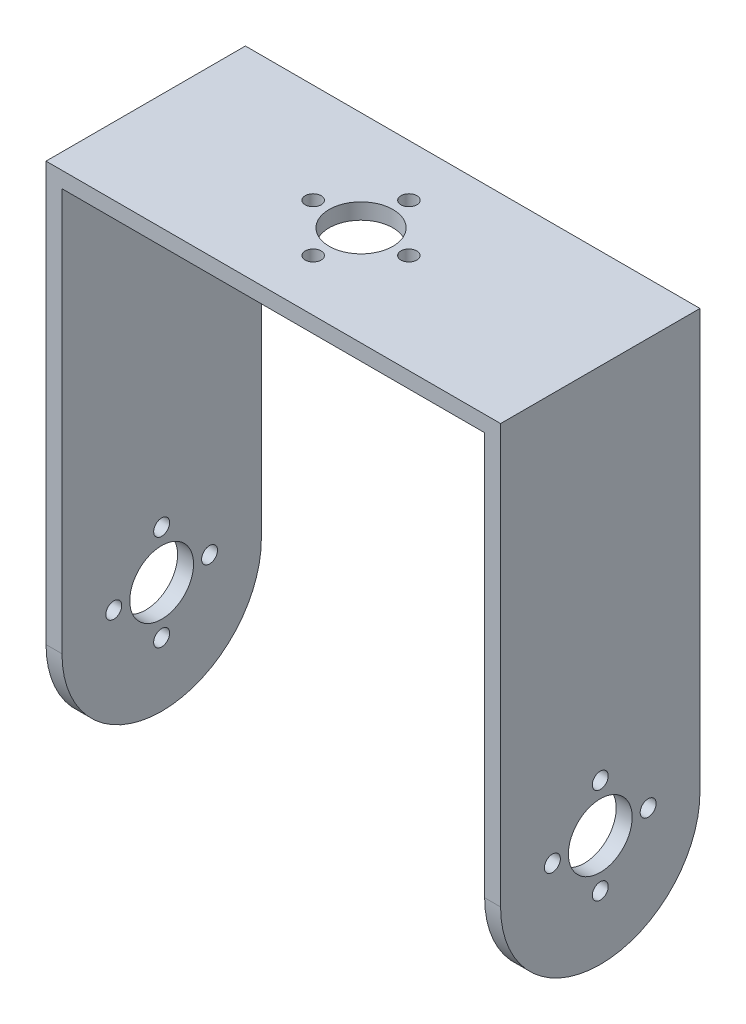
ISO-10303-21;
HEADER;
FILE_DESCRIPTION(('STEP AP214'),'2;1');
FILE_NAME('part.step','',(''),(''),'','','');
FILE_SCHEMA(('AUTOMOTIVE_DESIGN { 1 0 10303 214 1 1 1 1 }'));
ENDSEC;
DATA;
#1=APPLICATION_CONTEXT('core data for automotive mechanical design processes');
#2=APPLICATION_PROTOCOL_DEFINITION('international standard','automotive_design',2000,#1);
#3=PRODUCT_CONTEXT('',#1,'mechanical');
#4=PRODUCT('Part','Part','',(#3));
#5=PRODUCT_RELATED_PRODUCT_CATEGORY('part','',(#4));
#6=PRODUCT_DEFINITION_FORMATION('','',#4);
#7=PRODUCT_DEFINITION_CONTEXT('part definition',#1,'design');
#8=PRODUCT_DEFINITION('design','',#6,#7);
#9=PRODUCT_DEFINITION_SHAPE('','',#8);
#10=(LENGTH_UNIT() NAMED_UNIT(*) SI_UNIT(.MILLI.,.METRE.));
#11=(NAMED_UNIT(*) PLANE_ANGLE_UNIT() SI_UNIT($,.RADIAN.));
#12=(NAMED_UNIT(*) SI_UNIT($,.STERADIAN.) SOLID_ANGLE_UNIT());
#13=UNCERTAINTY_MEASURE_WITH_UNIT(LENGTH_MEASURE(1.E-05),#10,'distance_accuracy_value','');
#14=(GEOMETRIC_REPRESENTATION_CONTEXT(3) GLOBAL_UNCERTAINTY_ASSIGNED_CONTEXT((#13)) GLOBAL_UNIT_ASSIGNED_CONTEXT((#10,
#11,#12)) REPRESENTATION_CONTEXT('',''));
#15=CARTESIAN_POINT('',(0.,0.,0.));
#16=DIRECTION('',(0.,0.,1.));
#17=DIRECTION('',(1.,0.,0.));
#18=AXIS2_PLACEMENT_3D('',#15,#16,#17);
#19=CARTESIAN_POINT('',(-79.925523148209,43.3899538371544,25.));
#20=DIRECTION('',(-1.,0.,0.));
#21=DIRECTION('',(0.,0.,1.));
#22=AXIS2_PLACEMENT_3D('',#19,#20,#21);
#23=PLANE('',#22);
#24=CARTESIAN_POINT('',(-79.925523148209,0.391594966660007,12.4999999999999));
#25=DIRECTION('',(-1.,0.,0.));
#26=DIRECTION('',(0.,0.,1.));
#27=AXIS2_PLACEMENT_3D('',#24,#25,#26);
#28=CIRCLE('',#27,1.);
#29=CARTESIAN_POINT('',(-79.925523148209,0.391594966660007,13.4999999999999));
#30=VERTEX_POINT('',#29);
#31=EDGE_CURVE('E222',#30,#30,#28,.T.);
#32=ORIENTED_EDGE('',*,*,#31,.T.);
#33=EDGE_LOOP('',(#32));
#34=FACE_BOUND('',#33,.T.);
#35=CARTESIAN_POINT('',(-79.925523148209,-5.61349741649553,18.5050923831556));
#36=DIRECTION('',(-1.,0.,0.));
#37=DIRECTION('',(0.,0.,1.));
#38=AXIS2_PLACEMENT_3D('',#35,#36,#37);
#39=CIRCLE('',#38,1.);
#40=CARTESIAN_POINT('',(-79.925523148209,-5.61349741649553,19.5050923831556));
#41=VERTEX_POINT('',#40);
#42=EDGE_CURVE('E226',#41,#41,#39,.T.);
#43=ORIENTED_EDGE('',*,*,#42,.T.);
#44=EDGE_LOOP('',(#43));
#45=FACE_BOUND('',#44,.T.);
#46=CARTESIAN_POINT('',(-79.925523148209,-5.61349741649558,6.49490761684442));
#47=DIRECTION('',(-1.,0.,0.));
#48=DIRECTION('',(0.,0.,1.));
#49=AXIS2_PLACEMENT_3D('',#46,#47,#48);
#50=CIRCLE('',#49,1.);
#51=CARTESIAN_POINT('',(-79.925523148209,-5.61349741649558,7.49490761684442));
#52=VERTEX_POINT('',#51);
#53=EDGE_CURVE('E230',#52,#52,#50,.T.);
#54=ORIENTED_EDGE('',*,*,#53,.T.);
#55=EDGE_LOOP('',(#54));
#56=FACE_BOUND('',#55,.T.);
#57=CARTESIAN_POINT('',(-79.925523148209,-11.6185897996512,12.5));
#58=DIRECTION('',(-1.,0.,0.));
#59=DIRECTION('',(0.,0.,1.));
#60=AXIS2_PLACEMENT_3D('',#57,#58,#59);
#61=CIRCLE('',#60,1.);
#62=CARTESIAN_POINT('',(-79.925523148209,-11.6185897996512,13.5));
#63=VERTEX_POINT('',#62);
#64=EDGE_CURVE('E234',#63,#63,#61,.T.);
#65=ORIENTED_EDGE('',*,*,#64,.T.);
#66=EDGE_LOOP('',(#65));
#67=FACE_BOUND('',#66,.T.);
#68=CARTESIAN_POINT('',(-79.925523148209,-5.61349741649557,12.5));
#69=DIRECTION('',(-1.,0.,0.));
#70=DIRECTION('',(0.,0.,1.));
#71=AXIS2_PLACEMENT_3D('',#68,#69,#70);
#72=CIRCLE('',#71,4.);
#73=CARTESIAN_POINT('',(-79.925523148209,-5.61349741649557,16.5));
#74=VERTEX_POINT('',#73);
#75=EDGE_CURVE('E172',#74,#74,#72,.T.);
#76=ORIENTED_EDGE('',*,*,#75,.T.);
#77=EDGE_LOOP('',(#76));
#78=FACE_BOUND('',#77,.T.);
#79=DIRECTION('',(0.,1.,0.));
#80=VECTOR('',#79,1.);
#81=CARTESIAN_POINT('',(-79.925523148209,43.3899538371544,25.));
#82=LINE('',#81,#80);
#83=CARTESIAN_POINT('',(-79.925523148209,-7.11349741649558,25.));
#84=VERTEX_POINT('',#83);
#85=CARTESIAN_POINT('',(-79.925523148209,43.3899538371544,25.));
#86=VERTEX_POINT('',#85);
#87=EDGE_CURVE('E141',#84,#86,#82,.T.);
#88=ORIENTED_EDGE('',*,*,#87,.F.);
#89=CARTESIAN_POINT('',(-79.925523148209,-7.11349741649558,12.5));
#90=DIRECTION('',(-1.,0.,0.));
#91=DIRECTION('',(0.,0.,1.));
#92=AXIS2_PLACEMENT_3D('',#89,#90,#91);
#93=CIRCLE('',#92,12.5);
#94=CARTESIAN_POINT('',(-79.925523148209,-7.11349741649558,0.));
#95=VERTEX_POINT('',#94);
#96=EDGE_CURVE('E113',#95,#84,#93,.T.);
#97=ORIENTED_EDGE('',*,*,#96,.F.);
#98=DIRECTION('',(0.,1.,0.));
#99=VECTOR('',#98,1.);
#100=CARTESIAN_POINT('',(-79.925523148209,43.3899538371544,0.));
#101=LINE('',#100,#99);
#102=CARTESIAN_POINT('',(-79.925523148209,43.3899538371544,0.));
#103=VERTEX_POINT('',#102);
#104=EDGE_CURVE('E129',#95,#103,#101,.T.);
#105=ORIENTED_EDGE('',*,*,#104,.T.);
#106=DIRECTION('',(0.,0.,-1.));
#107=VECTOR('',#106,1.);
#108=CARTESIAN_POINT('',(-79.925523148209,43.3899538371544,25.));
#109=LINE('',#108,#107);
#110=EDGE_CURVE('E148',#86,#103,#109,.T.);
#111=ORIENTED_EDGE('',*,*,#110,.F.);
#112=EDGE_LOOP('',(#88,#97,#105,#111));
#113=FACE_BOUND('',#112,.T.);
#114=ADVANCED_FACE('F38',(#34,#45,#56,#67,#78,#113),#23,.F.);
#115=CARTESIAN_POINT('',(-26.925523148209,43.3899538371544,25.));
#116=DIRECTION('',(1.,0.,0.));
#117=DIRECTION('',(0.,1.,0.));
#118=AXIS2_PLACEMENT_3D('',#115,#116,#117);
#119=PLANE('',#118);
#120=CARTESIAN_POINT('',(-26.925523148209,0.391594966660024,12.4999999999999));
#121=DIRECTION('',(1.,0.,0.));
#122=DIRECTION('',(0.,1.,0.));
#123=AXIS2_PLACEMENT_3D('',#120,#121,#122);
#124=CIRCLE('',#123,1.);
#125=CARTESIAN_POINT('',(-26.925523148209,1.39159496666002,12.4999999999999));
#126=VERTEX_POINT('',#125);
#127=EDGE_CURVE('E429',#126,#126,#124,.T.);
#128=ORIENTED_EDGE('',*,*,#127,.T.);
#129=EDGE_LOOP('',(#128));
#130=FACE_BOUND('',#129,.T.);
#131=CARTESIAN_POINT('',(-26.925523148209,-5.61349741649552,18.5050923831556));
#132=DIRECTION('',(1.,0.,0.));
#133=DIRECTION('',(0.,1.,0.));
#134=AXIS2_PLACEMENT_3D('',#131,#132,#133);
#135=CIRCLE('',#134,1.);
#136=CARTESIAN_POINT('',(-26.925523148209,-4.61349741649552,18.5050923831556));
#137=VERTEX_POINT('',#136);
#138=EDGE_CURVE('E421',#137,#137,#135,.T.);
#139=ORIENTED_EDGE('',*,*,#138,.T.);
#140=EDGE_LOOP('',(#139));
#141=FACE_BOUND('',#140,.T.);
#142=CARTESIAN_POINT('',(-26.925523148209,-5.61349741649556,6.49490761684442));
#143=DIRECTION('',(1.,0.,0.));
#144=DIRECTION('',(0.,1.,0.));
#145=AXIS2_PLACEMENT_3D('',#142,#143,#144);
#146=CIRCLE('',#145,1.);
#147=CARTESIAN_POINT('',(-26.925523148209,-4.61349741649556,6.49490761684442));
#148=VERTEX_POINT('',#147);
#149=EDGE_CURVE('E287',#148,#148,#146,.T.);
#150=ORIENTED_EDGE('',*,*,#149,.T.);
#151=EDGE_LOOP('',(#150));
#152=FACE_BOUND('',#151,.T.);
#153=CARTESIAN_POINT('',(-26.925523148209,-11.6185897996511,12.5));
#154=DIRECTION('',(1.,0.,0.));
#155=DIRECTION('',(0.,1.,0.));
#156=AXIS2_PLACEMENT_3D('',#153,#154,#155);
#157=CIRCLE('',#156,1.);
#158=CARTESIAN_POINT('',(-26.925523148209,-10.6185897996511,12.5));
#159=VERTEX_POINT('',#158);
#160=EDGE_CURVE('E285',#159,#159,#157,.T.);
#161=ORIENTED_EDGE('',*,*,#160,.T.);
#162=EDGE_LOOP('',(#161));
#163=FACE_BOUND('',#162,.T.);
#164=CARTESIAN_POINT('',(-26.925523148209,-5.61349741649556,12.5));
#165=DIRECTION('',(1.,0.,0.));
#166=DIRECTION('',(0.,1.,0.));
#167=AXIS2_PLACEMENT_3D('',#164,#165,#166);
#168=CIRCLE('',#167,4.);
#169=CARTESIAN_POINT('',(-26.925523148209,-1.61349741649556,12.5));
#170=VERTEX_POINT('',#169);
#171=EDGE_CURVE('E168',#170,#170,#168,.T.);
#172=ORIENTED_EDGE('',*,*,#171,.T.);
#173=EDGE_LOOP('',(#172));
#174=FACE_BOUND('',#173,.T.);
#175=CARTESIAN_POINT('',(-26.925523148209,-7.11349741649557,12.5));
#176=DIRECTION('',(1.,0.,0.));
#177=DIRECTION('',(0.,1.,0.));
#178=AXIS2_PLACEMENT_3D('',#175,#176,#177);
#179=CIRCLE('',#178,12.5);
#180=CARTESIAN_POINT('',(-26.925523148209,-7.11349741649557,25.));
#181=VERTEX_POINT('',#180);
#182=CARTESIAN_POINT('',(-26.925523148209,-7.11349741649558,0.));
#183=VERTEX_POINT('',#182);
#184=EDGE_CURVE('E52',#181,#183,#179,.T.);
#185=ORIENTED_EDGE('',*,*,#184,.F.);
#186=DIRECTION('',(0.,-1.,0.));
#187=VECTOR('',#186,1.);
#188=CARTESIAN_POINT('',(-26.925523148209,43.3899538371544,25.));
#189=LINE('',#188,#187);
#190=CARTESIAN_POINT('',(-26.925523148209,43.3899538371544,25.));
#191=VERTEX_POINT('',#190);
#192=EDGE_CURVE('E183',#191,#181,#189,.T.);
#193=ORIENTED_EDGE('',*,*,#192,.F.);
#194=DIRECTION('',(0.,0.,-1.));
#195=VECTOR('',#194,1.);
#196=CARTESIAN_POINT('',(-26.925523148209,43.3899538371544,25.));
#197=LINE('',#196,#195);
#198=CARTESIAN_POINT('',(-26.925523148209,43.3899538371544,0.));
#199=VERTEX_POINT('',#198);
#200=EDGE_CURVE('E145',#191,#199,#197,.T.);
#201=ORIENTED_EDGE('',*,*,#200,.T.);
#202=DIRECTION('',(0.,-1.,0.));
#203=VECTOR('',#202,1.);
#204=CARTESIAN_POINT('',(-26.925523148209,43.3899538371544,0.));
#205=LINE('',#204,#203);
#206=EDGE_CURVE('E134',#199,#183,#205,.T.);
#207=ORIENTED_EDGE('',*,*,#206,.T.);
#208=EDGE_LOOP('',(#185,#193,#201,#207));
#209=FACE_BOUND('',#208,.T.);
#210=ADVANCED_FACE('F194',(#130,#141,#152,#163,#174,#209),#119,.F.);
#211=CARTESIAN_POINT('',(-24.925523148209,45.3865025835044,25.));
#212=DIRECTION('',(-1.,0.,0.));
#213=DIRECTION('',(0.,-1.,0.));
#214=AXIS2_PLACEMENT_3D('',#211,#212,#213);
#215=PLANE('',#214);
#216=CARTESIAN_POINT('',(-24.925523148209,0.391594966660025,12.4999999999999));
#217=DIRECTION('',(1.,0.,0.));
#218=DIRECTION('',(0.,1.,0.));
#219=AXIS2_PLACEMENT_3D('',#216,#217,#218);
#220=CIRCLE('',#219,1.);
#221=CARTESIAN_POINT('',(-24.925523148209,1.39159496666002,12.4999999999999));
#222=VERTEX_POINT('',#221);
#223=EDGE_CURVE('E264',#222,#222,#220,.T.);
#224=ORIENTED_EDGE('',*,*,#223,.F.);
#225=EDGE_LOOP('',(#224));
#226=FACE_BOUND('',#225,.T.);
#227=CARTESIAN_POINT('',(-24.925523148209,-5.61349741649552,18.5050923831556));
#228=DIRECTION('',(1.,0.,0.));
#229=DIRECTION('',(0.,1.,0.));
#230=AXIS2_PLACEMENT_3D('',#227,#228,#229);
#231=CIRCLE('',#230,1.);
#232=CARTESIAN_POINT('',(-24.925523148209,-4.61349741649552,18.5050923831556));
#233=VERTEX_POINT('',#232);
#234=EDGE_CURVE('E268',#233,#233,#231,.T.);
#235=ORIENTED_EDGE('',*,*,#234,.F.);
#236=EDGE_LOOP('',(#235));
#237=FACE_BOUND('',#236,.T.);
#238=CARTESIAN_POINT('',(-24.925523148209,-5.61349741649556,6.49490761684442));
#239=DIRECTION('',(1.,0.,0.));
#240=DIRECTION('',(0.,1.,0.));
#241=AXIS2_PLACEMENT_3D('',#238,#239,#240);
#242=CIRCLE('',#241,1.);
#243=CARTESIAN_POINT('',(-24.925523148209,-4.61349741649556,6.49490761684442));
#244=VERTEX_POINT('',#243);
#245=EDGE_CURVE('E272',#244,#244,#242,.T.);
#246=ORIENTED_EDGE('',*,*,#245,.F.);
#247=EDGE_LOOP('',(#246));
#248=FACE_BOUND('',#247,.T.);
#249=CARTESIAN_POINT('',(-24.925523148209,-11.6185897996511,12.5));
#250=DIRECTION('',(1.,0.,0.));
#251=DIRECTION('',(0.,1.,0.));
#252=AXIS2_PLACEMENT_3D('',#249,#250,#251);
#253=CIRCLE('',#252,1.);
#254=CARTESIAN_POINT('',(-24.925523148209,-10.6185897996511,12.5));
#255=VERTEX_POINT('',#254);
#256=EDGE_CURVE('E276',#255,#255,#253,.T.);
#257=ORIENTED_EDGE('',*,*,#256,.F.);
#258=EDGE_LOOP('',(#257));
#259=FACE_BOUND('',#258,.T.);
#260=CARTESIAN_POINT('',(-24.9255231482089,-5.61349741649556,12.5));
#261=DIRECTION('',(-1.,0.,0.));
#262=DIRECTION('',(0.,-1.,0.));
#263=AXIS2_PLACEMENT_3D('',#260,#261,#262);
#264=CIRCLE('',#263,4.);
#265=CARTESIAN_POINT('',(-24.9255231482089,-9.61349741649556,12.5));
#266=VERTEX_POINT('',#265);
#267=EDGE_CURVE('E161',#266,#266,#264,.T.);
#268=ORIENTED_EDGE('',*,*,#267,.T.);
#269=EDGE_LOOP('',(#268));
#270=FACE_BOUND('',#269,.T.);
#271=DIRECTION('',(0.,1.,0.));
#272=VECTOR('',#271,1.);
#273=CARTESIAN_POINT('',(-24.925523148209,45.3865025835044,25.));
#274=LINE('',#273,#272);
#275=CARTESIAN_POINT('',(-24.9255231482089,-7.11349741649557,25.));
#276=VERTEX_POINT('',#275);
#277=CARTESIAN_POINT('',(-24.925523148209,45.3865025835044,25.));
#278=VERTEX_POINT('',#277);
#279=EDGE_CURVE('E125',#276,#278,#274,.T.);
#280=ORIENTED_EDGE('',*,*,#279,.F.);
#281=CARTESIAN_POINT('',(-24.9255231482089,-7.11349741649557,12.5));
#282=DIRECTION('',(-1.,0.,0.));
#283=DIRECTION('',(0.,-1.,0.));
#284=AXIS2_PLACEMENT_3D('',#281,#282,#283);
#285=CIRCLE('',#284,12.5);
#286=CARTESIAN_POINT('',(-24.9255231482089,-7.11349741649557,0.));
#287=VERTEX_POINT('',#286);
#288=EDGE_CURVE('E107',#287,#276,#285,.T.);
#289=ORIENTED_EDGE('',*,*,#288,.F.);
#290=DIRECTION('',(0.,1.,0.));
#291=VECTOR('',#290,1.);
#292=CARTESIAN_POINT('',(-24.925523148209,45.3865025835044,0.));
#293=LINE('',#292,#291);
#294=CARTESIAN_POINT('',(-24.925523148209,45.3865025835044,0.));
#295=VERTEX_POINT('',#294);
#296=EDGE_CURVE('E137',#287,#295,#293,.T.);
#297=ORIENTED_EDGE('',*,*,#296,.T.);
#298=DIRECTION('',(0.,0.,-1.));
#299=VECTOR('',#298,1.);
#300=CARTESIAN_POINT('',(-24.925523148209,45.3865025835044,25.));
#301=LINE('',#300,#299);
#302=EDGE_CURVE('E123',#278,#295,#301,.T.);
#303=ORIENTED_EDGE('',*,*,#302,.F.);
#304=EDGE_LOOP('',(#280,#289,#297,#303));
#305=FACE_BOUND('',#304,.T.);
#306=ADVANCED_FACE('F189',(#226,#237,#248,#259,#270,#305),#215,.F.);
#307=CARTESIAN_POINT('',(-81.925523148209,45.3865025835044,25.));
#308=DIRECTION('',(1.,0.,0.));
#309=DIRECTION('',(0.,1.,0.));
#310=AXIS2_PLACEMENT_3D('',#307,#308,#309);
#311=PLANE('',#310);
#312=CARTESIAN_POINT('',(-81.925523148209,0.391594966660006,12.4999999999999));
#313=DIRECTION('',(1.,0.,0.));
#314=DIRECTION('',(0.,1.,0.));
#315=AXIS2_PLACEMENT_3D('',#312,#313,#314);
#316=CIRCLE('',#315,1.);
#317=CARTESIAN_POINT('',(-81.925523148209,1.39159496666001,12.4999999999999));
#318=VERTEX_POINT('',#317);
#319=EDGE_CURVE('E432',#318,#318,#316,.T.);
#320=ORIENTED_EDGE('',*,*,#319,.T.);
#321=EDGE_LOOP('',(#320));
#322=FACE_BOUND('',#321,.T.);
#323=CARTESIAN_POINT('',(-81.925523148209,-5.61349741649553,18.5050923831556));
#324=DIRECTION('',(1.,0.,0.));
#325=DIRECTION('',(0.,1.,0.));
#326=AXIS2_PLACEMENT_3D('',#323,#324,#325);
#327=CIRCLE('',#326,1.);
#328=CARTESIAN_POINT('',(-81.925523148209,-4.61349741649553,18.5050923831556));
#329=VERTEX_POINT('',#328);
#330=EDGE_CURVE('E424',#329,#329,#327,.T.);
#331=ORIENTED_EDGE('',*,*,#330,.T.);
#332=EDGE_LOOP('',(#331));
#333=FACE_BOUND('',#332,.T.);
#334=CARTESIAN_POINT('',(-81.925523148209,-5.61349741649558,6.49490761684442));
#335=DIRECTION('',(1.,0.,0.));
#336=DIRECTION('',(0.,1.,0.));
#337=AXIS2_PLACEMENT_3D('',#334,#335,#336);
#338=CIRCLE('',#337,1.);
#339=CARTESIAN_POINT('',(-81.925523148209,-4.61349741649558,6.49490761684442));
#340=VERTEX_POINT('',#339);
#341=EDGE_CURVE('E413',#340,#340,#338,.T.);
#342=ORIENTED_EDGE('',*,*,#341,.T.);
#343=EDGE_LOOP('',(#342));
#344=FACE_BOUND('',#343,.T.);
#345=CARTESIAN_POINT('',(-81.925523148209,-11.6185897996512,12.5));
#346=DIRECTION('',(1.,0.,0.));
#347=DIRECTION('',(0.,1.,0.));
#348=AXIS2_PLACEMENT_3D('',#345,#346,#347);
#349=CIRCLE('',#348,1.);
#350=CARTESIAN_POINT('',(-81.925523148209,-10.6185897996512,12.5));
#351=VERTEX_POINT('',#350);
#352=EDGE_CURVE('E282',#351,#351,#349,.T.);
#353=ORIENTED_EDGE('',*,*,#352,.T.);
#354=EDGE_LOOP('',(#353));
#355=FACE_BOUND('',#354,.T.);
#356=CARTESIAN_POINT('',(-81.925523148209,-5.61349741649557,12.5));
#357=DIRECTION('',(-1.,0.,0.));
#358=DIRECTION('',(0.,-1.,0.));
#359=AXIS2_PLACEMENT_3D('',#356,#357,#358);
#360=CIRCLE('',#359,4.);
#361=CARTESIAN_POINT('',(-81.925523148209,-9.61349741649557,12.5));
#362=VERTEX_POINT('',#361);
#363=EDGE_CURVE('E158',#362,#362,#360,.T.);
#364=ORIENTED_EDGE('',*,*,#363,.F.);
#365=EDGE_LOOP('',(#364));
#366=FACE_BOUND('',#365,.T.);
#367=CARTESIAN_POINT('',(-81.925523148209,-7.11349741649558,12.5));
#368=DIRECTION('',(-1.,0.,0.));
#369=DIRECTION('',(0.,-1.,0.));
#370=AXIS2_PLACEMENT_3D('',#367,#368,#369);
#371=CIRCLE('',#370,12.5);
#372=CARTESIAN_POINT('',(-81.925523148209,-7.11349741649558,0.));
#373=VERTEX_POINT('',#372);
#374=CARTESIAN_POINT('',(-81.925523148209,-7.11349741649558,25.));
#375=VERTEX_POINT('',#374);
#376=EDGE_CURVE('E59',#373,#375,#371,.T.);
#377=ORIENTED_EDGE('',*,*,#376,.T.);
#378=DIRECTION('',(0.,-1.,0.));
#379=VECTOR('',#378,1.);
#380=CARTESIAN_POINT('',(-81.925523148209,45.3865025835044,25.));
#381=LINE('',#380,#379);
#382=CARTESIAN_POINT('',(-81.925523148209,45.3865025835044,25.));
#383=VERTEX_POINT('',#382);
#384=EDGE_CURVE('E104',#383,#375,#381,.T.);
#385=ORIENTED_EDGE('',*,*,#384,.F.);
#386=DIRECTION('',(0.,0.,-1.));
#387=VECTOR('',#386,1.);
#388=CARTESIAN_POINT('',(-81.925523148209,45.3865025835044,25.));
#389=LINE('',#388,#387);
#390=CARTESIAN_POINT('',(-81.925523148209,45.3865025835044,0.));
#391=VERTEX_POINT('',#390);
#392=EDGE_CURVE('E121',#383,#391,#389,.T.);
#393=ORIENTED_EDGE('',*,*,#392,.T.);
#394=DIRECTION('',(0.,-1.,0.));
#395=VECTOR('',#394,1.);
#396=CARTESIAN_POINT('',(-81.925523148209,45.3865025835044,0.));
#397=LINE('',#396,#395);
#398=EDGE_CURVE('E106',#391,#373,#397,.T.);
#399=ORIENTED_EDGE('',*,*,#398,.T.);
#400=EDGE_LOOP('',(#377,#385,#393,#399));
#401=FACE_BOUND('',#400,.T.);
#402=ADVANCED_FACE('F101',(#322,#333,#344,#355,#366,#401),#311,.F.);
#403=CARTESIAN_POINT('',(-79.925523148209,43.3899538371544,25.));
#404=DIRECTION('',(0.,1.,0.));
#405=DIRECTION('',(0.,0.,1.));
#406=AXIS2_PLACEMENT_3D('',#403,#404,#405);
#407=PLANE('',#406);
#408=CARTESIAN_POINT('',(-60.9255242227313,43.3899538371544,12.4999988656517));
#409=DIRECTION('',(0.,1.,0.));
#410=DIRECTION('',(0.,0.,1.));
#411=AXIS2_PLACEMENT_3D('',#408,#409,#410);
#412=CIRCLE('',#411,1.);
#413=CARTESIAN_POINT('',(-60.9255242227313,43.3899538371544,13.4999988656517));
#414=VERTEX_POINT('',#413);
#415=EDGE_CURVE('E454',#414,#414,#412,.T.);
#416=ORIENTED_EDGE('',*,*,#415,.T.);
#417=EDGE_LOOP('',(#416));
#418=FACE_BOUND('',#417,.T.);
#419=CARTESIAN_POINT('',(-54.9255242227312,43.3899538371544,18.4999988656516));
#420=DIRECTION('',(0.,1.,0.));
#421=DIRECTION('',(0.,0.,1.));
#422=AXIS2_PLACEMENT_3D('',#419,#420,#421);
#423=CIRCLE('',#422,1.);
#424=CARTESIAN_POINT('',(-54.9255242227312,43.3899538371544,19.4999988656517));
#425=VERTEX_POINT('',#424);
#426=EDGE_CURVE('E448',#425,#425,#423,.T.);
#427=ORIENTED_EDGE('',*,*,#426,.T.);
#428=EDGE_LOOP('',(#427));
#429=FACE_BOUND('',#428,.T.);
#430=CARTESIAN_POINT('',(-48.9255242227313,43.3899538371544,12.4999988656516));
#431=DIRECTION('',(0.,1.,0.));
#432=DIRECTION('',(0.,0.,1.));
#433=AXIS2_PLACEMENT_3D('',#430,#431,#432);
#434=CIRCLE('',#433,0.999999999999996);
#435=CARTESIAN_POINT('',(-48.9255242227313,43.3899538371544,13.4999988656516));
#436=VERTEX_POINT('',#435);
#437=EDGE_CURVE('E442',#436,#436,#434,.T.);
#438=ORIENTED_EDGE('',*,*,#437,.T.);
#439=EDGE_LOOP('',(#438));
#440=FACE_BOUND('',#439,.T.);
#441=CARTESIAN_POINT('',(-54.9255242227314,43.3899538371544,6.49999886565165));
#442=DIRECTION('',(0.,1.,0.));
#443=DIRECTION('',(0.,0.,1.));
#444=AXIS2_PLACEMENT_3D('',#441,#442,#443);
#445=CIRCLE('',#444,0.999999999999998);
#446=CARTESIAN_POINT('',(-54.9255242227314,43.3899538371544,7.49999886565164));
#447=VERTEX_POINT('',#446);
#448=EDGE_CURVE('E434',#447,#447,#445,.T.);
#449=ORIENTED_EDGE('',*,*,#448,.T.);
#450=EDGE_LOOP('',(#449));
#451=FACE_BOUND('',#450,.T.);
#452=CARTESIAN_POINT('',(-54.925523148209,43.3899538371544,12.5));
#453=DIRECTION('',(0.,1.,0.));
#454=DIRECTION('',(0.,0.,1.));
#455=AXIS2_PLACEMENT_3D('',#452,#453,#454);
#456=CIRCLE('',#455,4.00000000000001);
#457=CARTESIAN_POINT('',(-54.925523148209,43.3899538371544,16.5));
#458=VERTEX_POINT('',#457);
#459=EDGE_CURVE('E132',#458,#458,#456,.T.);
#460=ORIENTED_EDGE('',*,*,#459,.T.);
#461=EDGE_LOOP('',(#460));
#462=FACE_BOUND('',#461,.T.);
#463=DIRECTION('',(1.,0.,0.));
#464=VECTOR('',#463,1.);
#465=CARTESIAN_POINT('',(-79.925523148209,43.3899538371544,0.));
#466=LINE('',#465,#464);
#467=EDGE_CURVE('E131',#103,#199,#466,.T.);
#468=ORIENTED_EDGE('',*,*,#467,.T.);
#469=ORIENTED_EDGE('',*,*,#200,.F.);
#470=DIRECTION('',(1.,0.,0.));
#471=VECTOR('',#470,1.);
#472=CARTESIAN_POINT('',(-79.925523148209,43.3899538371544,25.));
#473=LINE('',#472,#471);
#474=EDGE_CURVE('E181',#86,#191,#473,.T.);
#475=ORIENTED_EDGE('',*,*,#474,.F.);
#476=ORIENTED_EDGE('',*,*,#110,.T.);
#477=EDGE_LOOP('',(#468,#469,#475,#476));
#478=FACE_BOUND('',#477,.T.);
#479=ADVANCED_FACE('F199',(#418,#429,#440,#451,#462,#478),#407,.F.);
#480=CARTESIAN_POINT('',(-81.925523148209,45.3865025835044,25.));
#481=DIRECTION('',(0.,-1.,0.));
#482=DIRECTION('',(0.,0.,-1.));
#483=AXIS2_PLACEMENT_3D('',#480,#481,#482);
#484=PLANE('',#483);
#485=CARTESIAN_POINT('',(-60.9255242227313,45.3865025835044,12.4999988656517));
#486=DIRECTION('',(0.,1.,0.));
#487=DIRECTION('',(0.,0.,1.));
#488=AXIS2_PLACEMENT_3D('',#485,#486,#487);
#489=CIRCLE('',#488,1.);
#490=CARTESIAN_POINT('',(-60.9255242227313,45.3865025835044,13.4999988656517));
#491=VERTEX_POINT('',#490);
#492=EDGE_CURVE('E456',#491,#491,#489,.T.);
#493=ORIENTED_EDGE('',*,*,#492,.F.);
#494=EDGE_LOOP('',(#493));
#495=FACE_BOUND('',#494,.T.);
#496=CARTESIAN_POINT('',(-54.9255242227312,45.3865025835044,18.4999988656516));
#497=DIRECTION('',(0.,1.,0.));
#498=DIRECTION('',(0.,0.,1.));
#499=AXIS2_PLACEMENT_3D('',#496,#497,#498);
#500=CIRCLE('',#499,1.);
#501=CARTESIAN_POINT('',(-54.9255242227312,45.3865025835044,19.4999988656517));
#502=VERTEX_POINT('',#501);
#503=EDGE_CURVE('E451',#502,#502,#500,.T.);
#504=ORIENTED_EDGE('',*,*,#503,.F.);
#505=EDGE_LOOP('',(#504));
#506=FACE_BOUND('',#505,.T.);
#507=CARTESIAN_POINT('',(-48.9255242227313,45.3865025835044,12.4999988656516));
#508=DIRECTION('',(0.,1.,0.));
#509=DIRECTION('',(0.,0.,1.));
#510=AXIS2_PLACEMENT_3D('',#507,#508,#509);
#511=CIRCLE('',#510,0.999999999999996);
#512=CARTESIAN_POINT('',(-48.9255242227313,45.3865025835044,13.4999988656516));
#513=VERTEX_POINT('',#512);
#514=EDGE_CURVE('E445',#513,#513,#511,.T.);
#515=ORIENTED_EDGE('',*,*,#514,.F.);
#516=EDGE_LOOP('',(#515));
#517=FACE_BOUND('',#516,.T.);
#518=CARTESIAN_POINT('',(-54.9255242227314,45.3865025835044,6.49999886565165));
#519=DIRECTION('',(0.,1.,0.));
#520=DIRECTION('',(0.,0.,1.));
#521=AXIS2_PLACEMENT_3D('',#518,#519,#520);
#522=CIRCLE('',#521,0.999999999999998);
#523=CARTESIAN_POINT('',(-54.9255242227314,45.3865025835044,7.49999886565164));
#524=VERTEX_POINT('',#523);
#525=EDGE_CURVE('E439',#524,#524,#522,.T.);
#526=ORIENTED_EDGE('',*,*,#525,.F.);
#527=EDGE_LOOP('',(#526));
#528=FACE_BOUND('',#527,.T.);
#529=CARTESIAN_POINT('',(-54.925523148209,45.3865025835044,12.5));
#530=DIRECTION('',(0.,1.,0.));
#531=DIRECTION('',(0.,0.,1.));
#532=AXIS2_PLACEMENT_3D('',#529,#530,#531);
#533=CIRCLE('',#532,4.00000000000001);
#534=CARTESIAN_POINT('',(-54.925523148209,45.3865025835044,16.5));
#535=VERTEX_POINT('',#534);
#536=EDGE_CURVE('E175',#535,#535,#533,.T.);
#537=ORIENTED_EDGE('',*,*,#536,.F.);
#538=EDGE_LOOP('',(#537));
#539=FACE_BOUND('',#538,.T.);
#540=DIRECTION('',(-1.,0.,0.));
#541=VECTOR('',#540,1.);
#542=CARTESIAN_POINT('',(-81.925523148209,45.3865025835044,0.));
#543=LINE('',#542,#541);
#544=EDGE_CURVE('E139',#295,#391,#543,.T.);
#545=ORIENTED_EDGE('',*,*,#544,.T.);
#546=ORIENTED_EDGE('',*,*,#392,.F.);
#547=DIRECTION('',(-1.,0.,0.));
#548=VECTOR('',#547,1.);
#549=CARTESIAN_POINT('',(-27.0429671921119,45.3865025835044,25.));
#550=LINE('',#549,#548);
#551=EDGE_CURVE('E119',#278,#383,#550,.T.);
#552=ORIENTED_EDGE('',*,*,#551,.F.);
#553=ORIENTED_EDGE('',*,*,#302,.T.);
#554=EDGE_LOOP('',(#545,#546,#552,#553));
#555=FACE_BOUND('',#554,.T.);
#556=ADVANCED_FACE('F191',(#495,#506,#517,#528,#539,#555),#484,.F.);
#557=CARTESIAN_POINT('',(0.,0.,25.));
#558=DIRECTION('',(0.,0.,1.));
#559=DIRECTION('',(1.,0.,0.));
#560=AXIS2_PLACEMENT_3D('',#557,#558,#559);
#561=PLANE('',#560);
#562=DIRECTION('',(-1.,0.,0.));
#563=VECTOR('',#562,1.);
#564=CARTESIAN_POINT('',(-24.9255231482089,-7.11349741649557,25.));
#565=LINE('',#564,#563);
#566=EDGE_CURVE('E108',#276,#181,#565,.T.);
#567=ORIENTED_EDGE('',*,*,#566,.F.);
#568=ORIENTED_EDGE('',*,*,#279,.T.);
#569=ORIENTED_EDGE('',*,*,#551,.T.);
#570=ORIENTED_EDGE('',*,*,#384,.T.);
#571=DIRECTION('',(-1.,0.,0.));
#572=VECTOR('',#571,1.);
#573=CARTESIAN_POINT('',(-24.9255231482089,-7.11349741649557,25.));
#574=LINE('',#573,#572);
#575=EDGE_CURVE('E11',#84,#375,#574,.T.);
#576=ORIENTED_EDGE('',*,*,#575,.F.);
#577=ORIENTED_EDGE('',*,*,#87,.T.);
#578=ORIENTED_EDGE('',*,*,#474,.T.);
#579=ORIENTED_EDGE('',*,*,#192,.T.);
#580=EDGE_LOOP('',(#567,#568,#569,#570,#576,#577,#578,#579));
#581=FACE_BOUND('',#580,.T.);
#582=ADVANCED_FACE('F117',(#581),#561,.T.);
#583=CARTESIAN_POINT('',(0.,0.,0.));
#584=DIRECTION('',(0.,0.,1.));
#585=DIRECTION('',(1.,0.,0.));
#586=AXIS2_PLACEMENT_3D('',#583,#584,#585);
#587=PLANE('',#586);
#588=ORIENTED_EDGE('',*,*,#296,.F.);
#589=DIRECTION('',(-1.,0.,0.));
#590=VECTOR('',#589,1.);
#591=CARTESIAN_POINT('',(-24.9255231482089,-7.11349741649557,0.));
#592=LINE('',#591,#590);
#593=EDGE_CURVE('E163',#287,#183,#592,.T.);
#594=ORIENTED_EDGE('',*,*,#593,.T.);
#595=ORIENTED_EDGE('',*,*,#206,.F.);
#596=ORIENTED_EDGE('',*,*,#467,.F.);
#597=ORIENTED_EDGE('',*,*,#104,.F.);
#598=DIRECTION('',(-1.,0.,0.));
#599=VECTOR('',#598,1.);
#600=CARTESIAN_POINT('',(-24.9255231482089,-7.11349741649557,0.));
#601=LINE('',#600,#599);
#602=EDGE_CURVE('E45',#95,#373,#601,.T.);
#603=ORIENTED_EDGE('',*,*,#602,.T.);
#604=ORIENTED_EDGE('',*,*,#398,.F.);
#605=ORIENTED_EDGE('',*,*,#544,.F.);
#606=EDGE_LOOP('',(#588,#594,#595,#596,#597,#603,#604,#605));
#607=FACE_BOUND('',#606,.T.);
#608=ADVANCED_FACE('F153',(#607),#587,.F.);
#609=CARTESIAN_POINT('',(-54.925523148209,-19.6134974164956,12.5));
#610=DIRECTION('',(0.,1.,0.));
#611=DIRECTION('',(0.,0.,1.));
#612=AXIS2_PLACEMENT_3D('',#609,#610,#611);
#613=CYLINDRICAL_SURFACE('',#612,4.00000000000001);
#614=ORIENTED_EDGE('',*,*,#536,.T.);
#615=EDGE_LOOP('',(#614));
#616=FACE_BOUND('',#615,.T.);
#617=ORIENTED_EDGE('',*,*,#459,.F.);
#618=EDGE_LOOP('',(#617));
#619=FACE_BOUND('',#618,.T.);
#620=ADVANCED_FACE('F240',(#616,#619),#613,.F.);
#621=CARTESIAN_POINT('',(-24.9255231482089,-5.61349741649556,12.5));
#622=DIRECTION('',(-1.,0.,0.));
#623=DIRECTION('',(0.,-1.,0.));
#624=AXIS2_PLACEMENT_3D('',#621,#622,#623);
#625=CYLINDRICAL_SURFACE('',#624,4.);
#626=ORIENTED_EDGE('',*,*,#363,.T.);
#627=EDGE_LOOP('',(#626));
#628=FACE_BOUND('',#627,.T.);
#629=ORIENTED_EDGE('',*,*,#75,.F.);
#630=EDGE_LOOP('',(#629));
#631=FACE_BOUND('',#630,.T.);
#632=ADVANCED_FACE('F237',(#628,#631),#625,.F.);
#633=ORIENTED_EDGE('',*,*,#267,.F.);
#634=EDGE_LOOP('',(#633));
#635=FACE_BOUND('',#634,.T.);
#636=ORIENTED_EDGE('',*,*,#171,.F.);
#637=EDGE_LOOP('',(#636));
#638=FACE_BOUND('',#637,.T.);
#639=ADVANCED_FACE('F239',(#635,#638),#625,.F.);
#640=CARTESIAN_POINT('',(-24.9255231482089,-7.11349741649557,12.5));
#641=DIRECTION('',(-1.,0.,0.));
#642=DIRECTION('',(0.,-1.,0.));
#643=AXIS2_PLACEMENT_3D('',#640,#641,#642);
#644=CYLINDRICAL_SURFACE('',#643,12.5);
#645=ORIENTED_EDGE('',*,*,#96,.T.);
#646=ORIENTED_EDGE('',*,*,#575,.T.);
#647=ORIENTED_EDGE('',*,*,#376,.F.);
#648=ORIENTED_EDGE('',*,*,#602,.F.);
#649=EDGE_LOOP('',(#645,#646,#647,#648));
#650=FACE_BOUND('',#649,.T.);
#651=ADVANCED_FACE('F111',(#650),#644,.T.);
#652=ORIENTED_EDGE('',*,*,#184,.T.);
#653=ORIENTED_EDGE('',*,*,#593,.F.);
#654=ORIENTED_EDGE('',*,*,#288,.T.);
#655=ORIENTED_EDGE('',*,*,#566,.T.);
#656=EDGE_LOOP('',(#652,#653,#654,#655));
#657=FACE_BOUND('',#656,.T.);
#658=ADVANCED_FACE('F294',(#657),#644,.T.);
#659=CARTESIAN_POINT('',(-81.925523148209,-11.6185897996512,12.5));
#660=DIRECTION('',(1.,0.,0.));
#661=DIRECTION('',(0.,1.,0.));
#662=AXIS2_PLACEMENT_3D('',#659,#660,#661);
#663=CYLINDRICAL_SURFACE('',#662,1.);
#664=ORIENTED_EDGE('',*,*,#352,.F.);
#665=EDGE_LOOP('',(#664));
#666=FACE_BOUND('',#665,.T.);
#667=ORIENTED_EDGE('',*,*,#64,.F.);
#668=EDGE_LOOP('',(#667));
#669=FACE_BOUND('',#668,.T.);
#670=ADVANCED_FACE('F296',(#666,#669),#663,.F.);
#671=ORIENTED_EDGE('',*,*,#256,.T.);
#672=EDGE_LOOP('',(#671));
#673=FACE_BOUND('',#672,.T.);
#674=ORIENTED_EDGE('',*,*,#160,.F.);
#675=EDGE_LOOP('',(#674));
#676=FACE_BOUND('',#675,.T.);
#677=ADVANCED_FACE('F301',(#673,#676),#663,.F.);
#678=CARTESIAN_POINT('',(-81.925523148209,-5.61349741649558,6.49490761684442));
#679=DIRECTION('',(1.,0.,0.));
#680=DIRECTION('',(0.,1.,0.));
#681=AXIS2_PLACEMENT_3D('',#678,#679,#680);
#682=CYLINDRICAL_SURFACE('',#681,1.);
#683=ORIENTED_EDGE('',*,*,#341,.F.);
#684=EDGE_LOOP('',(#683));
#685=FACE_BOUND('',#684,.T.);
#686=ORIENTED_EDGE('',*,*,#53,.F.);
#687=EDGE_LOOP('',(#686));
#688=FACE_BOUND('',#687,.T.);
#689=ADVANCED_FACE('F402',(#685,#688),#682,.F.);
#690=ORIENTED_EDGE('',*,*,#245,.T.);
#691=EDGE_LOOP('',(#690));
#692=FACE_BOUND('',#691,.T.);
#693=ORIENTED_EDGE('',*,*,#149,.F.);
#694=EDGE_LOOP('',(#693));
#695=FACE_BOUND('',#694,.T.);
#696=ADVANCED_FACE('F400',(#692,#695),#682,.F.);
#697=CARTESIAN_POINT('',(-81.925523148209,-5.61349741649553,18.5050923831556));
#698=DIRECTION('',(1.,0.,0.));
#699=DIRECTION('',(0.,1.,0.));
#700=AXIS2_PLACEMENT_3D('',#697,#698,#699);
#701=CYLINDRICAL_SURFACE('',#700,1.);
#702=ORIENTED_EDGE('',*,*,#330,.F.);
#703=EDGE_LOOP('',(#702));
#704=FACE_BOUND('',#703,.T.);
#705=ORIENTED_EDGE('',*,*,#42,.F.);
#706=EDGE_LOOP('',(#705));
#707=FACE_BOUND('',#706,.T.);
#708=ADVANCED_FACE('F397',(#704,#707),#701,.F.);
#709=ORIENTED_EDGE('',*,*,#234,.T.);
#710=EDGE_LOOP('',(#709));
#711=FACE_BOUND('',#710,.T.);
#712=ORIENTED_EDGE('',*,*,#138,.F.);
#713=EDGE_LOOP('',(#712));
#714=FACE_BOUND('',#713,.T.);
#715=ADVANCED_FACE('F395',(#711,#714),#701,.F.);
#716=CARTESIAN_POINT('',(-81.925523148209,0.391594966660006,12.4999999999999));
#717=DIRECTION('',(1.,0.,0.));
#718=DIRECTION('',(0.,1.,0.));
#719=AXIS2_PLACEMENT_3D('',#716,#717,#718);
#720=CYLINDRICAL_SURFACE('',#719,1.);
#721=ORIENTED_EDGE('',*,*,#319,.F.);
#722=EDGE_LOOP('',(#721));
#723=FACE_BOUND('',#722,.T.);
#724=ORIENTED_EDGE('',*,*,#31,.F.);
#725=EDGE_LOOP('',(#724));
#726=FACE_BOUND('',#725,.T.);
#727=ADVANCED_FACE('F392',(#723,#726),#720,.F.);
#728=ORIENTED_EDGE('',*,*,#223,.T.);
#729=EDGE_LOOP('',(#728));
#730=FACE_BOUND('',#729,.T.);
#731=ORIENTED_EDGE('',*,*,#127,.F.);
#732=EDGE_LOOP('',(#731));
#733=FACE_BOUND('',#732,.T.);
#734=ADVANCED_FACE('F353',(#730,#733),#720,.F.);
#735=CARTESIAN_POINT('',(-54.9255242227314,-19.6134974164956,6.49999886565165));
#736=DIRECTION('',(0.,1.,0.));
#737=DIRECTION('',(0.,0.,1.));
#738=AXIS2_PLACEMENT_3D('',#735,#736,#737);
#739=CYLINDRICAL_SURFACE('',#738,0.999999999999998);
#740=ORIENTED_EDGE('',*,*,#525,.T.);
#741=EDGE_LOOP('',(#740));
#742=FACE_BOUND('',#741,.T.);
#743=ORIENTED_EDGE('',*,*,#448,.F.);
#744=EDGE_LOOP('',(#743));
#745=FACE_BOUND('',#744,.T.);
#746=ADVANCED_FACE('F347',(#742,#745),#739,.F.);
#747=CARTESIAN_POINT('',(-48.9255242227313,-19.6134974164956,12.4999988656516));
#748=DIRECTION('',(0.,1.,0.));
#749=DIRECTION('',(0.,0.,1.));
#750=AXIS2_PLACEMENT_3D('',#747,#748,#749);
#751=CYLINDRICAL_SURFACE('',#750,0.999999999999996);
#752=ORIENTED_EDGE('',*,*,#514,.T.);
#753=EDGE_LOOP('',(#752));
#754=FACE_BOUND('',#753,.T.);
#755=ORIENTED_EDGE('',*,*,#437,.F.);
#756=EDGE_LOOP('',(#755));
#757=FACE_BOUND('',#756,.T.);
#758=ADVANCED_FACE('F352',(#754,#757),#751,.F.);
#759=CARTESIAN_POINT('',(-54.9255242227312,-19.6134974164956,18.4999988656516));
#760=DIRECTION('',(0.,1.,0.));
#761=DIRECTION('',(0.,0.,1.));
#762=AXIS2_PLACEMENT_3D('',#759,#760,#761);
#763=CYLINDRICAL_SURFACE('',#762,1.);
#764=ORIENTED_EDGE('',*,*,#503,.T.);
#765=EDGE_LOOP('',(#764));
#766=FACE_BOUND('',#765,.T.);
#767=ORIENTED_EDGE('',*,*,#426,.F.);
#768=EDGE_LOOP('',(#767));
#769=FACE_BOUND('',#768,.T.);
#770=ADVANCED_FACE('F365',(#766,#769),#763,.F.);
#771=CARTESIAN_POINT('',(-60.9255242227313,-19.6134974164956,12.4999988656517));
#772=DIRECTION('',(0.,1.,0.));
#773=DIRECTION('',(0.,0.,1.));
#774=AXIS2_PLACEMENT_3D('',#771,#772,#773);
#775=CYLINDRICAL_SURFACE('',#774,1.);
#776=ORIENTED_EDGE('',*,*,#492,.T.);
#777=EDGE_LOOP('',(#776));
#778=FACE_BOUND('',#777,.T.);
#779=ORIENTED_EDGE('',*,*,#415,.F.);
#780=EDGE_LOOP('',(#779));
#781=FACE_BOUND('',#780,.T.);
#782=ADVANCED_FACE('F375',(#778,#781),#775,.F.);
#783=CLOSED_SHELL('',(#114,#210,#306,#402,#479,#556,#582,#608,#620,#632,#639,#651,#658,#670,
#677,#689,#696,#708,#715,#727,#734,#746,#758,#770,#782));
#784=MANIFOLD_SOLID_BREP('B2',#783);
#785=ADVANCED_BREP_SHAPE_REPRESENTATION('',(#18,#784),#14);
#786=SHAPE_DEFINITION_REPRESENTATION(#9,#785);
ENDSEC;
END-ISO-10303-21;
